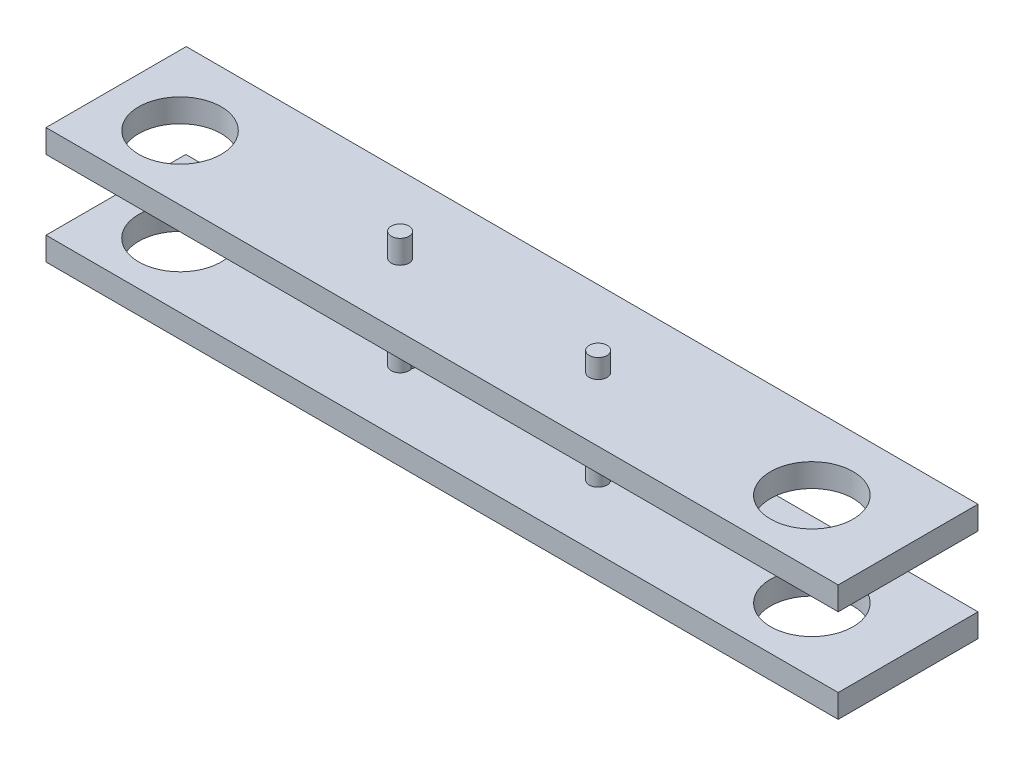
ISO-10303-21;
HEADER;
FILE_DESCRIPTION(('STEP AP214'),'2;1');
FILE_NAME('part.step','',(''),(''),'','','');
FILE_SCHEMA(('AUTOMOTIVE_DESIGN { 1 0 10303 214 1 1 1 1 }'));
ENDSEC;
DATA;
#1=APPLICATION_CONTEXT('core data for automotive mechanical design processes');
#2=APPLICATION_PROTOCOL_DEFINITION('international standard','automotive_design',2000,#1);
#3=PRODUCT_CONTEXT('',#1,'mechanical');
#4=PRODUCT('Part','Part','',(#3));
#5=PRODUCT_RELATED_PRODUCT_CATEGORY('part','',(#4));
#6=PRODUCT_DEFINITION_FORMATION('','',#4);
#7=PRODUCT_DEFINITION_CONTEXT('part definition',#1,'design');
#8=PRODUCT_DEFINITION('design','',#6,#7);
#9=PRODUCT_DEFINITION_SHAPE('','',#8);
#10=(LENGTH_UNIT() NAMED_UNIT(*) SI_UNIT(.MILLI.,.METRE.));
#11=(NAMED_UNIT(*) PLANE_ANGLE_UNIT() SI_UNIT($,.RADIAN.));
#12=(NAMED_UNIT(*) SI_UNIT($,.STERADIAN.) SOLID_ANGLE_UNIT());
#13=UNCERTAINTY_MEASURE_WITH_UNIT(LENGTH_MEASURE(1.E-05),#10,'distance_accuracy_value','');
#14=(GEOMETRIC_REPRESENTATION_CONTEXT(3) GLOBAL_UNCERTAINTY_ASSIGNED_CONTEXT((#13)) GLOBAL_UNIT_ASSIGNED_CONTEXT((#10,
#11,#12)) REPRESENTATION_CONTEXT('',''));
#15=CARTESIAN_POINT('',(0.,0.,0.));
#16=DIRECTION('',(0.,0.,1.));
#17=DIRECTION('',(1.,0.,0.));
#18=AXIS2_PLACEMENT_3D('',#15,#16,#17);
#19=CARTESIAN_POINT('',(0.,50.8,0.));
#20=DIRECTION('',(0.,1.,0.));
#21=DIRECTION('',(0.,0.,1.));
#22=AXIS2_PLACEMENT_3D('',#19,#20,#21);
#23=PLANE('',#22);
#24=CARTESIAN_POINT('',(158.865028896233,50.8,-34.9050267443315));
#25=DIRECTION('',(0.,1.,0.));
#26=DIRECTION('',(0.,0.,1.));
#27=AXIS2_PLACEMENT_3D('',#24,#25,#26);
#28=CIRCLE('',#27,4.82599999999999);
#29=CARTESIAN_POINT('',(158.865028896233,50.8,-30.0790267443316));
#30=VERTEX_POINT('',#29);
#31=EDGE_CURVE('E121',#30,#30,#28,.F.);
#32=ORIENTED_EDGE('',*,*,#31,.F.);
#33=EDGE_LOOP('',(#32));
#34=FACE_BOUND('',#33,.T.);
#35=CARTESIAN_POINT('',(-69.2560615585089,50.8,-35.1078849562754));
#36=DIRECTION('',(0.,1.,0.));
#37=DIRECTION('',(0.,0.,1.));
#38=AXIS2_PLACEMENT_3D('',#35,#36,#37);
#39=CIRCLE('',#38,22.479);
#40=CARTESIAN_POINT('',(-69.2560615585089,50.8,-12.6288849562754));
#41=VERTEX_POINT('',#40);
#42=EDGE_CURVE('E137',#41,#41,#39,.T.);
#43=ORIENTED_EDGE('',*,*,#42,.T.);
#44=EDGE_LOOP('',(#43));
#45=FACE_BOUND('',#44,.T.);
#46=DIRECTION('',(0.,0.,-1.));
#47=VECTOR('',#46,1.);
#48=CARTESIAN_POINT('',(-107.196051217765,50.8,0.));
#49=LINE('',#48,#47);
#50=CARTESIAN_POINT('',(-107.196051217765,50.8,0.));
#51=VERTEX_POINT('',#50);
#52=CARTESIAN_POINT('',(-107.196051217765,50.8,-76.4396790680239));
#53=VERTEX_POINT('',#52);
#54=EDGE_CURVE('E195',#51,#53,#49,.T.);
#55=ORIENTED_EDGE('',*,*,#54,.T.);
#56=DIRECTION('',(0.999999845948886,0.,0.000555069548636108));
#57=VECTOR('',#56,1.);
#58=CARTESIAN_POINT('',(0.0423963042822688,50.8,-76.3801542621916));
#59=LINE('',#58,#57);
#60=CARTESIAN_POINT('',(324.603948782235,50.8,-76.2));
#61=VERTEX_POINT('',#60);
#62=EDGE_CURVE('E185',#53,#61,#59,.T.);
#63=ORIENTED_EDGE('',*,*,#62,.T.);
#64=DIRECTION('',(0.,0.,1.));
#65=VECTOR('',#64,1.);
#66=CARTESIAN_POINT('',(324.603948782235,50.8,0.));
#67=LINE('',#66,#65);
#68=CARTESIAN_POINT('',(324.603948782235,50.8,0.));
#69=VERTEX_POINT('',#68);
#70=EDGE_CURVE('E189',#61,#69,#67,.T.);
#71=ORIENTED_EDGE('',*,*,#70,.T.);
#72=DIRECTION('',(-1.,0.,0.));
#73=VECTOR('',#72,1.);
#74=CARTESIAN_POINT('',(0.,50.8,0.));
#75=LINE('',#74,#73);
#76=EDGE_CURVE('E192',#69,#51,#75,.T.);
#77=ORIENTED_EDGE('',*,*,#76,.T.);
#78=EDGE_LOOP('',(#55,#63,#71,#77));
#79=FACE_BOUND('',#78,.T.);
#80=CARTESIAN_POINT('',(275.131003884369,50.8,-35.1078849562754));
#81=DIRECTION('',(0.,1.,0.));
#82=DIRECTION('',(0.,0.,1.));
#83=AXIS2_PLACEMENT_3D('',#80,#81,#82);
#84=CIRCLE('',#83,22.479);
#85=CARTESIAN_POINT('',(275.131003884369,50.8,-12.6288849562753));
#86=VERTEX_POINT('',#85);
#87=EDGE_CURVE('E136',#86,#86,#84,.F.);
#88=ORIENTED_EDGE('',*,*,#87,.F.);
#89=EDGE_LOOP('',(#88));
#90=FACE_BOUND('',#89,.T.);
#91=CARTESIAN_POINT('',(50.9150288962327,50.8,-34.9050267443315));
#92=DIRECTION('',(0.,1.,0.));
#93=DIRECTION('',(0.,0.,1.));
#94=AXIS2_PLACEMENT_3D('',#91,#92,#93);
#95=CIRCLE('',#94,4.826);
#96=CARTESIAN_POINT('',(55.517685250575,50.8,-36.3561747325919));
#97=VERTEX_POINT('',#96);
#98=CARTESIAN_POINT('',(46.415101181619,50.8,-36.6488520117396));
#99=VERTEX_POINT('',#98);
#100=EDGE_CURVE('E114',#97,#99,#95,.F.);
#101=ORIENTED_EDGE('',*,*,#100,.F.);
#102=CARTESIAN_POINT('',(51.0177575359613,50.8,-38.1));
#103=DIRECTION('',(0.,1.,0.));
#104=DIRECTION('',(0.,0.,1.));
#105=AXIS2_PLACEMENT_3D('',#102,#103,#104);
#106=CIRCLE('',#105,4.826);
#107=EDGE_CURVE('E106',#97,#99,#106,.T.);
#108=ORIENTED_EDGE('',*,*,#107,.T.);
#109=EDGE_LOOP('',(#101,#108));
#110=FACE_BOUND('',#109,.T.);
#111=ADVANCED_FACE('F35',(#34,#45,#79,#90,#110),#23,.F.);
#112=CARTESIAN_POINT('',(-53.9189320678128,63.5,-38.1));
#113=DIRECTION('',(0.,1.,0.));
#114=DIRECTION('',(0.,0.,1.));
#115=AXIS2_PLACEMENT_3D('',#112,#113,#114);
#116=PLANE('',#115);
#117=CARTESIAN_POINT('',(158.865028896233,63.5,-34.9050267443315));
#118=DIRECTION('',(0.,1.,0.));
#119=DIRECTION('',(0.,0.,1.));
#120=AXIS2_PLACEMENT_3D('',#117,#118,#119);
#121=CIRCLE('',#120,4.82599999999999);
#122=CARTESIAN_POINT('',(158.865028896233,63.5,-30.0790267443316));
#123=VERTEX_POINT('',#122);
#124=EDGE_CURVE('E128',#123,#123,#121,.F.);
#125=ORIENTED_EDGE('',*,*,#124,.T.);
#126=EDGE_LOOP('',(#125));
#127=FACE_BOUND('',#126,.T.);
#128=CARTESIAN_POINT('',(-69.2560615585089,63.5,-35.1078849562754));
#129=DIRECTION('',(0.,1.,0.));
#130=DIRECTION('',(0.,0.,1.));
#131=AXIS2_PLACEMENT_3D('',#128,#129,#130);
#132=CIRCLE('',#131,22.479);
#133=CARTESIAN_POINT('',(-69.2560615585089,63.5,-12.6288849562754));
#134=VERTEX_POINT('',#133);
#135=EDGE_CURVE('E212',#134,#134,#132,.T.);
#136=ORIENTED_EDGE('',*,*,#135,.F.);
#137=EDGE_LOOP('',(#136));
#138=FACE_BOUND('',#137,.T.);
#139=DIRECTION('',(0.,0.,-1.));
#140=VECTOR('',#139,1.);
#141=CARTESIAN_POINT('',(-107.196051217765,63.5,0.));
#142=LINE('',#141,#140);
#143=CARTESIAN_POINT('',(-107.196051217765,63.5,0.));
#144=VERTEX_POINT('',#143);
#145=CARTESIAN_POINT('',(-107.196051217765,63.5,-76.4396790680239));
#146=VERTEX_POINT('',#145);
#147=EDGE_CURVE('E188',#144,#146,#142,.T.);
#148=ORIENTED_EDGE('',*,*,#147,.F.);
#149=DIRECTION('',(-1.,0.,0.));
#150=VECTOR('',#149,1.);
#151=CARTESIAN_POINT('',(0.,63.5,0.));
#152=LINE('',#151,#150);
#153=CARTESIAN_POINT('',(324.603948782235,63.5,0.));
#154=VERTEX_POINT('',#153);
#155=EDGE_CURVE('E203',#154,#144,#152,.T.);
#156=ORIENTED_EDGE('',*,*,#155,.F.);
#157=DIRECTION('',(0.,0.,1.));
#158=VECTOR('',#157,1.);
#159=CARTESIAN_POINT('',(324.603948782235,63.5,0.));
#160=LINE('',#159,#158);
#161=CARTESIAN_POINT('',(324.603948782235,63.5,-76.2));
#162=VERTEX_POINT('',#161);
#163=EDGE_CURVE('E200',#162,#154,#160,.T.);
#164=ORIENTED_EDGE('',*,*,#163,.F.);
#165=DIRECTION('',(0.999999845948886,0.,0.000555069548636108));
#166=VECTOR('',#165,1.);
#167=CARTESIAN_POINT('',(0.0423963042822688,63.5,-76.3801542621916));
#168=LINE('',#167,#166);
#169=EDGE_CURVE('E184',#146,#162,#168,.T.);
#170=ORIENTED_EDGE('',*,*,#169,.F.);
#171=EDGE_LOOP('',(#148,#156,#164,#170));
#172=FACE_BOUND('',#171,.T.);
#173=CARTESIAN_POINT('',(275.131003884369,63.5,-35.1078849562754));
#174=DIRECTION('',(0.,1.,0.));
#175=DIRECTION('',(0.,0.,1.));
#176=AXIS2_PLACEMENT_3D('',#173,#174,#175);
#177=CIRCLE('',#176,22.479);
#178=CARTESIAN_POINT('',(275.131003884369,63.5,-12.6288849562753));
#179=VERTEX_POINT('',#178);
#180=EDGE_CURVE('E134',#179,#179,#177,.F.);
#181=ORIENTED_EDGE('',*,*,#180,.T.);
#182=EDGE_LOOP('',(#181));
#183=FACE_BOUND('',#182,.T.);
#184=CARTESIAN_POINT('',(50.9150288962327,63.5,-34.9050267443315));
#185=DIRECTION('',(0.,1.,0.));
#186=DIRECTION('',(0.,0.,1.));
#187=AXIS2_PLACEMENT_3D('',#184,#185,#186);
#188=CIRCLE('',#187,4.826);
#189=CARTESIAN_POINT('',(50.9150288962327,63.5,-30.0790267443315));
#190=VERTEX_POINT('',#189);
#191=EDGE_CURVE('E226',#190,#190,#188,.F.);
#192=ORIENTED_EDGE('',*,*,#191,.T.);
#193=EDGE_LOOP('',(#192));
#194=FACE_BOUND('',#193,.T.);
#195=ADVANCED_FACE('F254',(#127,#138,#172,#183,#194),#116,.T.);
#196=CARTESIAN_POINT('',(0.,12.7,0.));
#197=DIRECTION('',(0.,-1.,0.));
#198=DIRECTION('',(0.,0.,-1.));
#199=AXIS2_PLACEMENT_3D('',#196,#197,#198);
#200=PLANE('',#199);
#201=CARTESIAN_POINT('',(158.865028896233,12.7,-34.9050267443315));
#202=DIRECTION('',(0.,-1.,0.));
#203=DIRECTION('',(0.,0.,-1.));
#204=AXIS2_PLACEMENT_3D('',#201,#202,#203);
#205=CIRCLE('',#204,4.82599999999999);
#206=CARTESIAN_POINT('',(158.865028896233,12.7,-39.7310267443315));
#207=VERTEX_POINT('',#206);
#208=EDGE_CURVE('E111',#207,#207,#205,.F.);
#209=ORIENTED_EDGE('',*,*,#208,.F.);
#210=EDGE_LOOP('',(#209));
#211=FACE_BOUND('',#210,.T.);
#212=CARTESIAN_POINT('',(-69.2560615585089,12.7,-35.1078849562754));
#213=DIRECTION('',(0.,-1.,0.));
#214=DIRECTION('',(0.,0.,-1.));
#215=AXIS2_PLACEMENT_3D('',#212,#213,#214);
#216=CIRCLE('',#215,22.479);
#217=CARTESIAN_POINT('',(-69.2560615585089,12.7,-57.5868849562754));
#218=VERTEX_POINT('',#217);
#219=EDGE_CURVE('E133',#218,#218,#216,.T.);
#220=ORIENTED_EDGE('',*,*,#219,.T.);
#221=EDGE_LOOP('',(#220));
#222=FACE_BOUND('',#221,.T.);
#223=DIRECTION('',(0.,0.,1.));
#224=VECTOR('',#223,1.);
#225=CARTESIAN_POINT('',(-107.196051217765,12.7,0.));
#226=LINE('',#225,#224);
#227=CARTESIAN_POINT('',(-107.196051217765,12.7,-76.2));
#228=VERTEX_POINT('',#227);
#229=CARTESIAN_POINT('',(-107.196051217765,12.7,0.));
#230=VERTEX_POINT('',#229);
#231=EDGE_CURVE('E154',#228,#230,#226,.T.);
#232=ORIENTED_EDGE('',*,*,#231,.T.);
#233=DIRECTION('',(1.,0.,0.));
#234=VECTOR('',#233,1.);
#235=CARTESIAN_POINT('',(-107.196051217765,12.7,0.));
#236=LINE('',#235,#234);
#237=CARTESIAN_POINT('',(324.603948782235,12.7,0.));
#238=VERTEX_POINT('',#237);
#239=EDGE_CURVE('E166',#230,#238,#236,.T.);
#240=ORIENTED_EDGE('',*,*,#239,.T.);
#241=DIRECTION('',(0.,0.,-1.));
#242=VECTOR('',#241,1.);
#243=CARTESIAN_POINT('',(324.603948782235,12.7,-76.2));
#244=LINE('',#243,#242);
#245=CARTESIAN_POINT('',(324.603948782235,12.7,-76.2));
#246=VERTEX_POINT('',#245);
#247=EDGE_CURVE('E164',#238,#246,#244,.T.);
#248=ORIENTED_EDGE('',*,*,#247,.T.);
#249=DIRECTION('',(-1.,0.,0.));
#250=VECTOR('',#249,1.);
#251=CARTESIAN_POINT('',(-107.196051217765,12.7,-76.2));
#252=LINE('',#251,#250);
#253=EDGE_CURVE('E151',#246,#228,#252,.T.);
#254=ORIENTED_EDGE('',*,*,#253,.T.);
#255=EDGE_LOOP('',(#232,#240,#248,#254));
#256=FACE_BOUND('',#255,.T.);
#257=CARTESIAN_POINT('',(275.131003884369,12.7,-35.1078849562754));
#258=DIRECTION('',(0.,-1.,0.));
#259=DIRECTION('',(0.,0.,-1.));
#260=AXIS2_PLACEMENT_3D('',#257,#258,#259);
#261=CIRCLE('',#260,22.479);
#262=CARTESIAN_POINT('',(275.131003884369,12.7,-57.5868849562754));
#263=VERTEX_POINT('',#262);
#264=EDGE_CURVE('E162',#263,#263,#261,.F.);
#265=ORIENTED_EDGE('',*,*,#264,.F.);
#266=EDGE_LOOP('',(#265));
#267=FACE_BOUND('',#266,.T.);
#268=CARTESIAN_POINT('',(50.9150288962327,12.7,-34.9050267443315));
#269=DIRECTION('',(0.,-1.,0.));
#270=DIRECTION('',(0.,0.,-1.));
#271=AXIS2_PLACEMENT_3D('',#268,#269,#270);
#272=CIRCLE('',#271,4.826);
#273=CARTESIAN_POINT('',(46.415101181619,12.7,-36.6488520117396));
#274=VERTEX_POINT('',#273);
#275=CARTESIAN_POINT('',(55.517685250575,12.7,-36.3561747325919));
#276=VERTEX_POINT('',#275);
#277=EDGE_CURVE('E117',#274,#276,#272,.F.);
#278=ORIENTED_EDGE('',*,*,#277,.F.);
#279=CARTESIAN_POINT('',(51.0177575359613,12.7,-38.1));
#280=DIRECTION('',(0.,-1.,0.));
#281=DIRECTION('',(0.,0.,-1.));
#282=AXIS2_PLACEMENT_3D('',#279,#280,#281);
#283=CIRCLE('',#282,4.826);
#284=EDGE_CURVE('E112',#276,#274,#283,.F.);
#285=ORIENTED_EDGE('',*,*,#284,.F.);
#286=EDGE_LOOP('',(#278,#285));
#287=FACE_BOUND('',#286,.T.);
#288=ADVANCED_FACE('F260',(#211,#222,#256,#267,#287),#200,.F.);
#289=CARTESIAN_POINT('',(0.,0.,0.));
#290=DIRECTION('',(0.,-1.,0.));
#291=DIRECTION('',(0.,0.,-1.));
#292=AXIS2_PLACEMENT_3D('',#289,#290,#291);
#293=PLANE('',#292);
#294=CARTESIAN_POINT('',(158.865028896233,0.,-34.9050267443315));
#295=DIRECTION('',(0.,-1.,0.));
#296=DIRECTION('',(0.,0.,-1.));
#297=AXIS2_PLACEMENT_3D('',#294,#295,#296);
#298=CIRCLE('',#297,4.82599999999999);
#299=CARTESIAN_POINT('',(158.865028896233,0.,-39.7310267443315));
#300=VERTEX_POINT('',#299);
#301=EDGE_CURVE('E125',#300,#300,#298,.F.);
#302=ORIENTED_EDGE('',*,*,#301,.T.);
#303=EDGE_LOOP('',(#302));
#304=FACE_BOUND('',#303,.T.);
#305=CARTESIAN_POINT('',(-69.2560615585089,0.,-35.1078849562754));
#306=DIRECTION('',(0.,-1.,0.));
#307=DIRECTION('',(0.,0.,-1.));
#308=AXIS2_PLACEMENT_3D('',#305,#306,#307);
#309=CIRCLE('',#308,22.479);
#310=CARTESIAN_POINT('',(-69.2560615585089,0.,-57.5868849562754));
#311=VERTEX_POINT('',#310);
#312=EDGE_CURVE('E130',#311,#311,#309,.T.);
#313=ORIENTED_EDGE('',*,*,#312,.F.);
#314=EDGE_LOOP('',(#313));
#315=FACE_BOUND('',#314,.T.);
#316=DIRECTION('',(0.,0.,1.));
#317=VECTOR('',#316,1.);
#318=CARTESIAN_POINT('',(-107.196051217765,0.,0.));
#319=LINE('',#318,#317);
#320=CARTESIAN_POINT('',(-107.196051217765,0.,-76.2));
#321=VERTEX_POINT('',#320);
#322=CARTESIAN_POINT('',(-107.196051217765,0.,0.));
#323=VERTEX_POINT('',#322);
#324=EDGE_CURVE('E159',#321,#323,#319,.T.);
#325=ORIENTED_EDGE('',*,*,#324,.F.);
#326=DIRECTION('',(-1.,0.,0.));
#327=VECTOR('',#326,1.);
#328=CARTESIAN_POINT('',(-107.196051217765,0.,-76.2));
#329=LINE('',#328,#327);
#330=CARTESIAN_POINT('',(324.603948782235,0.,-76.2));
#331=VERTEX_POINT('',#330);
#332=EDGE_CURVE('E152',#331,#321,#329,.T.);
#333=ORIENTED_EDGE('',*,*,#332,.F.);
#334=DIRECTION('',(0.,0.,-1.));
#335=VECTOR('',#334,1.);
#336=CARTESIAN_POINT('',(324.603948782235,0.,-76.2));
#337=LINE('',#336,#335);
#338=CARTESIAN_POINT('',(324.603948782235,0.,0.));
#339=VERTEX_POINT('',#338);
#340=EDGE_CURVE('E155',#339,#331,#337,.T.);
#341=ORIENTED_EDGE('',*,*,#340,.F.);
#342=DIRECTION('',(1.,0.,0.));
#343=VECTOR('',#342,1.);
#344=CARTESIAN_POINT('',(-107.196051217765,0.,0.));
#345=LINE('',#344,#343);
#346=EDGE_CURVE('E157',#323,#339,#345,.T.);
#347=ORIENTED_EDGE('',*,*,#346,.F.);
#348=EDGE_LOOP('',(#325,#333,#341,#347));
#349=FACE_BOUND('',#348,.T.);
#350=CARTESIAN_POINT('',(275.131003884369,0.,-35.1078849562754));
#351=DIRECTION('',(0.,1.,0.));
#352=DIRECTION('',(0.,0.,1.));
#353=AXIS2_PLACEMENT_3D('',#350,#351,#352);
#354=CIRCLE('',#353,22.479);
#355=CARTESIAN_POINT('',(275.131003884369,0.,-12.6288849562753));
#356=VERTEX_POINT('',#355);
#357=EDGE_CURVE('E173',#356,#356,#354,.T.);
#358=ORIENTED_EDGE('',*,*,#357,.T.);
#359=EDGE_LOOP('',(#358));
#360=FACE_BOUND('',#359,.T.);
#361=CARTESIAN_POINT('',(50.9150288962327,0.,-34.9050267443315));
#362=DIRECTION('',(0.,-1.,0.));
#363=DIRECTION('',(0.,0.,-1.));
#364=AXIS2_PLACEMENT_3D('',#361,#362,#363);
#365=CIRCLE('',#364,4.826);
#366=CARTESIAN_POINT('',(50.9150288962327,0.,-39.7310267443315));
#367=VERTEX_POINT('',#366);
#368=EDGE_CURVE('E116',#367,#367,#365,.F.);
#369=ORIENTED_EDGE('',*,*,#368,.T.);
#370=EDGE_LOOP('',(#369));
#371=FACE_BOUND('',#370,.T.);
#372=ADVANCED_FACE('F291',(#304,#315,#349,#360,#371),#293,.T.);
#373=CARTESIAN_POINT('',(51.0177575359613,63.5,-38.1));
#374=DIRECTION('',(0.,-1.,0.));
#375=DIRECTION('',(0.,0.,-1.));
#376=AXIS2_PLACEMENT_3D('',#373,#374,#375);
#377=CYLINDRICAL_SURFACE('',#376,4.826);
#378=DIRECTION('',(0.,-1.,0.));
#379=VECTOR('',#378,1.);
#380=CARTESIAN_POINT('',(46.415101181619,31.496,-36.6488520117396));
#381=LINE('',#380,#379);
#382=EDGE_CURVE('E11',#99,#274,#381,.T.);
#383=ORIENTED_EDGE('',*,*,#382,.F.);
#384=ORIENTED_EDGE('',*,*,#107,.F.);
#385=DIRECTION('',(0.,-1.,0.));
#386=VECTOR('',#385,1.);
#387=CARTESIAN_POINT('',(55.517685250575,31.496,-36.3561747325919));
#388=LINE('',#387,#386);
#389=EDGE_CURVE('E43',#276,#97,#388,.F.);
#390=ORIENTED_EDGE('',*,*,#389,.F.);
#391=ORIENTED_EDGE('',*,*,#284,.T.);
#392=EDGE_LOOP('',(#383,#384,#390,#391));
#393=FACE_BOUND('',#392,.T.);
#394=ADVANCED_FACE('F108',(#393),#377,.T.);
#395=CARTESIAN_POINT('',(-107.196051217765,12.7,0.));
#396=DIRECTION('',(1.,0.,0.));
#397=DIRECTION('',(0.,0.,-1.));
#398=AXIS2_PLACEMENT_3D('',#395,#396,#397);
#399=PLANE('',#398);
#400=ORIENTED_EDGE('',*,*,#324,.T.);
#401=DIRECTION('',(0.,-1.,0.));
#402=VECTOR('',#401,1.);
#403=CARTESIAN_POINT('',(-107.196051217765,12.7,0.));
#404=LINE('',#403,#402);
#405=EDGE_CURVE('E139',#230,#323,#404,.T.);
#406=ORIENTED_EDGE('',*,*,#405,.F.);
#407=ORIENTED_EDGE('',*,*,#231,.F.);
#408=DIRECTION('',(0.,-1.,0.));
#409=VECTOR('',#408,1.);
#410=CARTESIAN_POINT('',(-107.196051217765,12.7,-76.2));
#411=LINE('',#410,#409);
#412=EDGE_CURVE('E148',#228,#321,#411,.T.);
#413=ORIENTED_EDGE('',*,*,#412,.T.);
#414=EDGE_LOOP('',(#400,#406,#407,#413));
#415=FACE_BOUND('',#414,.T.);
#416=ADVANCED_FACE('F37',(#415),#399,.F.);
#417=CARTESIAN_POINT('',(-107.196051217765,12.7,0.));
#418=DIRECTION('',(0.,0.,-1.));
#419=DIRECTION('',(-1.,0.,0.));
#420=AXIS2_PLACEMENT_3D('',#417,#418,#419);
#421=PLANE('',#420);
#422=ORIENTED_EDGE('',*,*,#346,.T.);
#423=DIRECTION('',(0.,-1.,0.));
#424=VECTOR('',#423,1.);
#425=CARTESIAN_POINT('',(324.603948782235,12.7,0.));
#426=LINE('',#425,#424);
#427=EDGE_CURVE('E142',#238,#339,#426,.T.);
#428=ORIENTED_EDGE('',*,*,#427,.F.);
#429=ORIENTED_EDGE('',*,*,#239,.F.);
#430=ORIENTED_EDGE('',*,*,#405,.T.);
#431=EDGE_LOOP('',(#422,#428,#429,#430));
#432=FACE_BOUND('',#431,.T.);
#433=ADVANCED_FACE('F304',(#432),#421,.F.);
#434=CARTESIAN_POINT('',(324.603948782235,12.7,-76.2));
#435=DIRECTION('',(-1.,0.,0.));
#436=DIRECTION('',(0.,0.,1.));
#437=AXIS2_PLACEMENT_3D('',#434,#435,#436);
#438=PLANE('',#437);
#439=ORIENTED_EDGE('',*,*,#340,.T.);
#440=DIRECTION('',(0.,-1.,0.));
#441=VECTOR('',#440,1.);
#442=CARTESIAN_POINT('',(324.603948782235,12.7,-76.2));
#443=LINE('',#442,#441);
#444=EDGE_CURVE('E145',#246,#331,#443,.T.);
#445=ORIENTED_EDGE('',*,*,#444,.F.);
#446=ORIENTED_EDGE('',*,*,#247,.F.);
#447=ORIENTED_EDGE('',*,*,#427,.T.);
#448=EDGE_LOOP('',(#439,#445,#446,#447));
#449=FACE_BOUND('',#448,.T.);
#450=ADVANCED_FACE('F301',(#449),#438,.F.);
#451=CARTESIAN_POINT('',(-107.196051217765,12.7,-76.2));
#452=DIRECTION('',(0.,0.,1.));
#453=DIRECTION('',(1.,0.,0.));
#454=AXIS2_PLACEMENT_3D('',#451,#452,#453);
#455=PLANE('',#454);
#456=ORIENTED_EDGE('',*,*,#332,.T.);
#457=ORIENTED_EDGE('',*,*,#412,.F.);
#458=ORIENTED_EDGE('',*,*,#253,.F.);
#459=ORIENTED_EDGE('',*,*,#444,.T.);
#460=EDGE_LOOP('',(#456,#457,#458,#459));
#461=FACE_BOUND('',#460,.T.);
#462=ADVANCED_FACE('F288',(#461),#455,.F.);
#463=CARTESIAN_POINT('',(275.131003884369,219.71,-35.1078849562754));
#464=DIRECTION('',(0.,-1.,0.));
#465=DIRECTION('',(0.,0.,-1.));
#466=AXIS2_PLACEMENT_3D('',#463,#464,#465);
#467=CYLINDRICAL_SURFACE('',#466,22.479);
#468=ORIENTED_EDGE('',*,*,#357,.F.);
#469=EDGE_LOOP('',(#468));
#470=FACE_BOUND('',#469,.T.);
#471=ORIENTED_EDGE('',*,*,#264,.T.);
#472=EDGE_LOOP('',(#471));
#473=FACE_BOUND('',#472,.T.);
#474=ADVANCED_FACE('F284',(#470,#473),#467,.F.);
#475=CARTESIAN_POINT('',(-107.196051217765,63.5,0.));
#476=DIRECTION('',(-1.,0.,0.));
#477=DIRECTION('',(0.,0.,1.));
#478=AXIS2_PLACEMENT_3D('',#475,#476,#477);
#479=PLANE('',#478);
#480=ORIENTED_EDGE('',*,*,#54,.F.);
#481=DIRECTION('',(0.,-1.,0.));
#482=VECTOR('',#481,1.);
#483=CARTESIAN_POINT('',(-107.196051217765,63.5,0.));
#484=LINE('',#483,#482);
#485=EDGE_CURVE('E176',#144,#51,#484,.T.);
#486=ORIENTED_EDGE('',*,*,#485,.F.);
#487=ORIENTED_EDGE('',*,*,#147,.T.);
#488=DIRECTION('',(0.,-1.,0.));
#489=VECTOR('',#488,1.);
#490=CARTESIAN_POINT('',(-107.196051217765,63.5,-76.4396790680239));
#491=LINE('',#490,#489);
#492=EDGE_CURVE('E182',#146,#53,#491,.T.);
#493=ORIENTED_EDGE('',*,*,#492,.T.);
#494=EDGE_LOOP('',(#480,#486,#487,#493));
#495=FACE_BOUND('',#494,.T.);
#496=ADVANCED_FACE('F280',(#495),#479,.T.);
#497=CARTESIAN_POINT('',(0.,63.5,0.));
#498=DIRECTION('',(0.,0.,1.));
#499=DIRECTION('',(1.,0.,0.));
#500=AXIS2_PLACEMENT_3D('',#497,#498,#499);
#501=PLANE('',#500);
#502=ORIENTED_EDGE('',*,*,#76,.F.);
#503=DIRECTION('',(0.,-1.,0.));
#504=VECTOR('',#503,1.);
#505=CARTESIAN_POINT('',(324.603948782235,63.5,0.));
#506=LINE('',#505,#504);
#507=EDGE_CURVE('E178',#154,#69,#506,.T.);
#508=ORIENTED_EDGE('',*,*,#507,.F.);
#509=ORIENTED_EDGE('',*,*,#155,.T.);
#510=ORIENTED_EDGE('',*,*,#485,.T.);
#511=EDGE_LOOP('',(#502,#508,#509,#510));
#512=FACE_BOUND('',#511,.T.);
#513=ADVANCED_FACE('F276',(#512),#501,.T.);
#514=CARTESIAN_POINT('',(324.603948782235,63.5,0.));
#515=DIRECTION('',(1.,0.,0.));
#516=DIRECTION('',(0.,0.,-1.));
#517=AXIS2_PLACEMENT_3D('',#514,#515,#516);
#518=PLANE('',#517);
#519=ORIENTED_EDGE('',*,*,#70,.F.);
#520=DIRECTION('',(0.,-1.,0.));
#521=VECTOR('',#520,1.);
#522=CARTESIAN_POINT('',(324.603948782235,63.5,-76.2));
#523=LINE('',#522,#521);
#524=EDGE_CURVE('E180',#162,#61,#523,.T.);
#525=ORIENTED_EDGE('',*,*,#524,.F.);
#526=ORIENTED_EDGE('',*,*,#163,.T.);
#527=ORIENTED_EDGE('',*,*,#507,.T.);
#528=EDGE_LOOP('',(#519,#525,#526,#527));
#529=FACE_BOUND('',#528,.T.);
#530=ADVANCED_FACE('F272',(#529),#518,.T.);
#531=CARTESIAN_POINT('',(0.0423963042822688,63.5,-76.3801542621916));
#532=DIRECTION('',(0.000555069548636108,0.,-0.999999845948886));
#533=DIRECTION('',(-0.999999845948886,0.,-0.000555069548636108));
#534=AXIS2_PLACEMENT_3D('',#531,#532,#533);
#535=PLANE('',#534);
#536=ORIENTED_EDGE('',*,*,#62,.F.);
#537=ORIENTED_EDGE('',*,*,#492,.F.);
#538=ORIENTED_EDGE('',*,*,#169,.T.);
#539=ORIENTED_EDGE('',*,*,#524,.T.);
#540=EDGE_LOOP('',(#536,#537,#538,#539));
#541=FACE_BOUND('',#540,.T.);
#542=ADVANCED_FACE('F269',(#541),#535,.T.);
#543=CARTESIAN_POINT('',(275.131003884369,-46.736,-35.1078849562754));
#544=DIRECTION('',(0.,1.,0.));
#545=DIRECTION('',(0.,0.,1.));
#546=AXIS2_PLACEMENT_3D('',#543,#544,#545);
#547=CYLINDRICAL_SURFACE('',#546,22.479);
#548=ORIENTED_EDGE('',*,*,#180,.F.);
#549=EDGE_LOOP('',(#548));
#550=FACE_BOUND('',#549,.T.);
#551=ORIENTED_EDGE('',*,*,#87,.T.);
#552=EDGE_LOOP('',(#551));
#553=FACE_BOUND('',#552,.T.);
#554=ADVANCED_FACE('F267',(#550,#553),#547,.F.);
#555=CARTESIAN_POINT('',(-69.2560615585089,-103.886,-35.1078849562754));
#556=DIRECTION('',(0.,1.,0.));
#557=DIRECTION('',(0.,0.,1.));
#558=AXIS2_PLACEMENT_3D('',#555,#556,#557);
#559=CYLINDRICAL_SURFACE('',#558,22.479);
#560=ORIENTED_EDGE('',*,*,#312,.T.);
#561=EDGE_LOOP('',(#560));
#562=FACE_BOUND('',#561,.T.);
#563=ORIENTED_EDGE('',*,*,#219,.F.);
#564=EDGE_LOOP('',(#563));
#565=FACE_BOUND('',#564,.T.);
#566=ADVANCED_FACE('F414',(#562,#565),#559,.F.);
#567=ORIENTED_EDGE('',*,*,#135,.T.);
#568=EDGE_LOOP('',(#567));
#569=FACE_BOUND('',#568,.T.);
#570=ORIENTED_EDGE('',*,*,#42,.F.);
#571=EDGE_LOOP('',(#570));
#572=FACE_BOUND('',#571,.T.);
#573=ADVANCED_FACE('F404',(#569,#572),#559,.F.);
#574=CARTESIAN_POINT('',(158.865028896233,-11.684,-34.9050267443315));
#575=DIRECTION('',(0.,1.,0.));
#576=DIRECTION('',(0.,0.,1.));
#577=AXIS2_PLACEMENT_3D('',#574,#575,#576);
#578=PLANE('',#577);
#579=CARTESIAN_POINT('',(158.865028896233,-11.684,-34.9050267443315));
#580=DIRECTION('',(0.,1.,0.));
#581=DIRECTION('',(0.,0.,1.));
#582=AXIS2_PLACEMENT_3D('',#579,#580,#581);
#583=CIRCLE('',#582,4.82599999999999);
#584=CARTESIAN_POINT('',(158.865028896233,-11.684,-30.0790267443316));
#585=VERTEX_POINT('',#584);
#586=EDGE_CURVE('E223',#585,#585,#583,.T.);
#587=ORIENTED_EDGE('',*,*,#586,.F.);
#588=EDGE_LOOP('',(#587));
#589=FACE_BOUND('',#588,.T.);
#590=ADVANCED_FACE('F395',(#589),#578,.F.);
#591=CARTESIAN_POINT('',(158.865028896233,73.914,-34.9050267443315));
#592=DIRECTION('',(0.,-1.,0.));
#593=DIRECTION('',(0.,0.,-1.));
#594=AXIS2_PLACEMENT_3D('',#591,#592,#593);
#595=CYLINDRICAL_SURFACE('',#594,4.82599999999999);
#596=ORIENTED_EDGE('',*,*,#301,.F.);
#597=EDGE_LOOP('',(#596));
#598=FACE_BOUND('',#597,.T.);
#599=ORIENTED_EDGE('',*,*,#586,.T.);
#600=EDGE_LOOP('',(#599));
#601=FACE_BOUND('',#600,.T.);
#602=ADVANCED_FACE('F379',(#598,#601),#595,.T.);
#603=ORIENTED_EDGE('',*,*,#208,.T.);
#604=EDGE_LOOP('',(#603));
#605=FACE_BOUND('',#604,.T.);
#606=ORIENTED_EDGE('',*,*,#31,.T.);
#607=EDGE_LOOP('',(#606));
#608=FACE_BOUND('',#607,.T.);
#609=ADVANCED_FACE('F376',(#605,#608),#595,.T.);
#610=ORIENTED_EDGE('',*,*,#124,.F.);
#611=EDGE_LOOP('',(#610));
#612=FACE_BOUND('',#611,.T.);
#613=CARTESIAN_POINT('',(158.865028896233,73.914,-34.9050267443315));
#614=DIRECTION('',(0.,1.,0.));
#615=DIRECTION('',(0.,0.,1.));
#616=AXIS2_PLACEMENT_3D('',#613,#614,#615);
#617=CIRCLE('',#616,4.82599999999999);
#618=CARTESIAN_POINT('',(158.865028896233,73.914,-30.0790267443316));
#619=VERTEX_POINT('',#618);
#620=EDGE_CURVE('E129',#619,#619,#617,.T.);
#621=ORIENTED_EDGE('',*,*,#620,.F.);
#622=EDGE_LOOP('',(#621));
#623=FACE_BOUND('',#622,.T.);
#624=ADVANCED_FACE('F366',(#612,#623),#595,.T.);
#625=CARTESIAN_POINT('',(158.865028896233,73.914,-34.9050267443315));
#626=DIRECTION('',(0.,1.,0.));
#627=DIRECTION('',(0.,0.,1.));
#628=AXIS2_PLACEMENT_3D('',#625,#626,#627);
#629=PLANE('',#628);
#630=ORIENTED_EDGE('',*,*,#620,.T.);
#631=EDGE_LOOP('',(#630));
#632=FACE_BOUND('',#631,.T.);
#633=ADVANCED_FACE('F251',(#632),#629,.T.);
#634=CARTESIAN_POINT('',(50.9150288962327,76.2,-34.9050267443315));
#635=DIRECTION('',(0.,-1.,0.));
#636=DIRECTION('',(0.,0.,-1.));
#637=AXIS2_PLACEMENT_3D('',#634,#635,#636);
#638=CYLINDRICAL_SURFACE('',#637,4.826);
#639=ORIENTED_EDGE('',*,*,#100,.T.);
#640=ORIENTED_EDGE('',*,*,#382,.T.);
#641=ORIENTED_EDGE('',*,*,#277,.T.);
#642=ORIENTED_EDGE('',*,*,#389,.T.);
#643=EDGE_LOOP('',(#639,#640,#641,#642));
#644=FACE_BOUND('',#643,.T.);
#645=ADVANCED_FACE('F120',(#644),#638,.T.);
#646=CARTESIAN_POINT('',(50.9150288962327,-13.208,-34.9050267443315));
#647=DIRECTION('',(0.,1.,0.));
#648=DIRECTION('',(0.,0.,1.));
#649=AXIS2_PLACEMENT_3D('',#646,#647,#648);
#650=PLANE('',#649);
#651=CARTESIAN_POINT('',(50.9150288962327,-13.208,-34.9050267443315));
#652=DIRECTION('',(0.,1.,0.));
#653=DIRECTION('',(0.,0.,1.));
#654=AXIS2_PLACEMENT_3D('',#651,#652,#653);
#655=CIRCLE('',#654,4.826);
#656=CARTESIAN_POINT('',(50.9150288962327,-13.208,-30.0790267443315));
#657=VERTEX_POINT('',#656);
#658=EDGE_CURVE('E235',#657,#657,#655,.T.);
#659=ORIENTED_EDGE('',*,*,#658,.F.);
#660=EDGE_LOOP('',(#659));
#661=FACE_BOUND('',#660,.T.);
#662=ADVANCED_FACE('F241',(#661),#650,.F.);
#663=ORIENTED_EDGE('',*,*,#368,.F.);
#664=EDGE_LOOP('',(#663));
#665=FACE_BOUND('',#664,.T.);
#666=ORIENTED_EDGE('',*,*,#658,.T.);
#667=EDGE_LOOP('',(#666));
#668=FACE_BOUND('',#667,.T.);
#669=ADVANCED_FACE('F239',(#665,#668),#638,.T.);
#670=ORIENTED_EDGE('',*,*,#191,.F.);
#671=EDGE_LOOP('',(#670));
#672=FACE_BOUND('',#671,.T.);
#673=CARTESIAN_POINT('',(50.9150288962327,76.2,-34.9050267443315));
#674=DIRECTION('',(0.,1.,0.));
#675=DIRECTION('',(0.,0.,1.));
#676=AXIS2_PLACEMENT_3D('',#673,#674,#675);
#677=CIRCLE('',#676,4.826);
#678=CARTESIAN_POINT('',(50.9150288962327,76.2,-30.0790267443315));
#679=VERTEX_POINT('',#678);
#680=EDGE_CURVE('E232',#679,#679,#677,.T.);
#681=ORIENTED_EDGE('',*,*,#680,.F.);
#682=EDGE_LOOP('',(#681));
#683=FACE_BOUND('',#682,.T.);
#684=ADVANCED_FACE('F248',(#672,#683),#638,.T.);
#685=CARTESIAN_POINT('',(50.9150288962327,76.2,-34.9050267443315));
#686=DIRECTION('',(0.,1.,0.));
#687=DIRECTION('',(0.,0.,1.));
#688=AXIS2_PLACEMENT_3D('',#685,#686,#687);
#689=PLANE('',#688);
#690=ORIENTED_EDGE('',*,*,#680,.T.);
#691=EDGE_LOOP('',(#690));
#692=FACE_BOUND('',#691,.T.);
#693=ADVANCED_FACE('F495',(#692),#689,.T.);
#694=CLOSED_SHELL('',(#111,#195,#288,#372,#394,#416,#433,#450,#462,#474,#496,#513,#530,#542,
#554,#566,#573,#590,#602,#609,#624,#633,#645,#662,#669,#684,#693));
#695=MANIFOLD_SOLID_BREP('B2',#694);
#696=ADVANCED_BREP_SHAPE_REPRESENTATION('',(#18,#695),#14);
#697=SHAPE_DEFINITION_REPRESENTATION(#9,#696);
ENDSEC;
END-ISO-10303-21;
